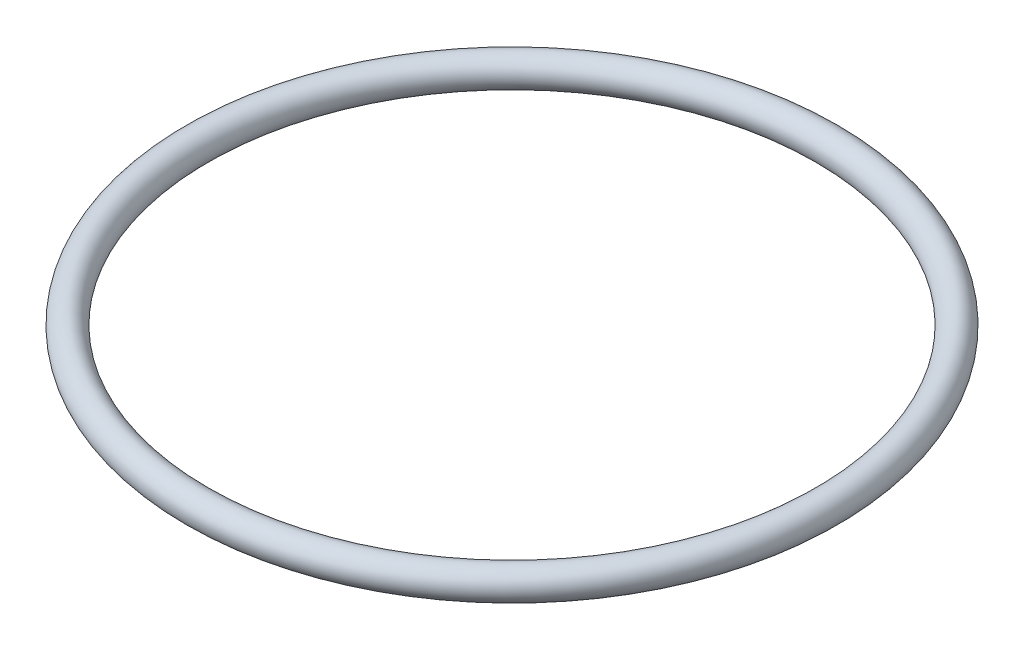
ISO-10303-21;
HEADER;
FILE_DESCRIPTION(('STEP AP214'),'2;1');
FILE_NAME('part.step','',(''),(''),'','','');
FILE_SCHEMA(('AUTOMOTIVE_DESIGN { 1 0 10303 214 1 1 1 1 }'));
ENDSEC;
DATA;
#1=APPLICATION_CONTEXT('core data for automotive mechanical design processes');
#2=APPLICATION_PROTOCOL_DEFINITION('international standard','automotive_design',2000,#1);
#3=PRODUCT_CONTEXT('',#1,'mechanical');
#4=PRODUCT('Part','Part','',(#3));
#5=PRODUCT_RELATED_PRODUCT_CATEGORY('part','',(#4));
#6=PRODUCT_DEFINITION_FORMATION('','',#4);
#7=PRODUCT_DEFINITION_CONTEXT('part definition',#1,'design');
#8=PRODUCT_DEFINITION('design','',#6,#7);
#9=PRODUCT_DEFINITION_SHAPE('','',#8);
#10=(LENGTH_UNIT() NAMED_UNIT(*) SI_UNIT(.MILLI.,.METRE.));
#11=(NAMED_UNIT(*) PLANE_ANGLE_UNIT() SI_UNIT($,.RADIAN.));
#12=(NAMED_UNIT(*) SI_UNIT($,.STERADIAN.) SOLID_ANGLE_UNIT());
#13=UNCERTAINTY_MEASURE_WITH_UNIT(LENGTH_MEASURE(1.E-05),#10,'distance_accuracy_value','');
#14=(GEOMETRIC_REPRESENTATION_CONTEXT(3) GLOBAL_UNCERTAINTY_ASSIGNED_CONTEXT((#13)) GLOBAL_UNIT_ASSIGNED_CONTEXT((#10,
#11,#12)) REPRESENTATION_CONTEXT('',''));
#15=CARTESIAN_POINT('',(0.,0.,0.));
#16=DIRECTION('',(0.,0.,1.));
#17=DIRECTION('',(1.,0.,0.));
#18=AXIS2_PLACEMENT_3D('',#15,#16,#17);
#19=CARTESIAN_POINT('',(-1.05196629915334,0.,0.));
#20=DIRECTION('',(0.,-1.,0.));
#21=DIRECTION('',(0.,0.,-1.));
#22=AXIS2_PLACEMENT_3D('',#19,#20,#21);
#23=TOROIDAL_SURFACE('',#22,20.7,1.);
#24=CARTESIAN_POINT('',(-1.05196629915334,0.,-21.7));
#25=VERTEX_POINT('',#24);
#26=VERTEX_LOOP('',#25);
#27=FACE_BOUND('',#26,.T.);
#28=ADVANCED_FACE('F31',(#27),#23,.T.);
#29=CLOSED_SHELL('',(#28));
#30=MANIFOLD_SOLID_BREP('B2',#29);
#31=ADVANCED_BREP_SHAPE_REPRESENTATION('',(#18,#30),#14);
#32=SHAPE_DEFINITION_REPRESENTATION(#9,#31);
ENDSEC;
END-ISO-10303-21;
